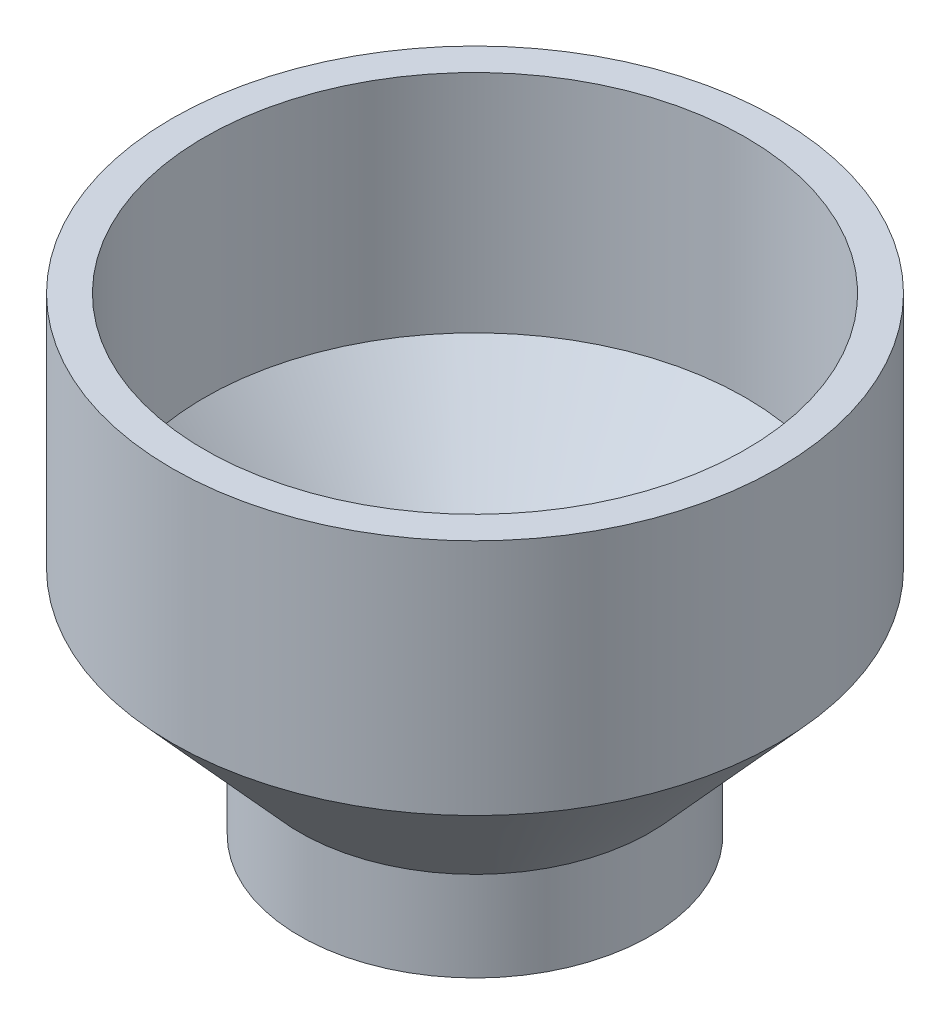
ISO-10303-21;
HEADER;
FILE_DESCRIPTION(('STEP AP214'),'2;1');
FILE_NAME('part.step','',(''),(''),'','','');
FILE_SCHEMA(('AUTOMOTIVE_DESIGN { 1 0 10303 214 1 1 1 1 }'));
ENDSEC;
DATA;
#1=APPLICATION_CONTEXT('core data for automotive mechanical design processes');
#2=APPLICATION_PROTOCOL_DEFINITION('international standard','automotive_design',2000,#1);
#3=PRODUCT_CONTEXT('',#1,'mechanical');
#4=PRODUCT('Part','Part','',(#3));
#5=PRODUCT_RELATED_PRODUCT_CATEGORY('part','',(#4));
#6=PRODUCT_DEFINITION_FORMATION('','',#4);
#7=PRODUCT_DEFINITION_CONTEXT('part definition',#1,'design');
#8=PRODUCT_DEFINITION('design','',#6,#7);
#9=PRODUCT_DEFINITION_SHAPE('','',#8);
#10=(LENGTH_UNIT() NAMED_UNIT(*) SI_UNIT(.MILLI.,.METRE.));
#11=(NAMED_UNIT(*) PLANE_ANGLE_UNIT() SI_UNIT($,.RADIAN.));
#12=(NAMED_UNIT(*) SI_UNIT($,.STERADIAN.) SOLID_ANGLE_UNIT());
#13=UNCERTAINTY_MEASURE_WITH_UNIT(LENGTH_MEASURE(1.E-05),#10,'distance_accuracy_value','');
#14=(GEOMETRIC_REPRESENTATION_CONTEXT(3) GLOBAL_UNCERTAINTY_ASSIGNED_CONTEXT((#13)) GLOBAL_UNIT_ASSIGNED_CONTEXT((#10,
#11,#12)) REPRESENTATION_CONTEXT('',''));
#15=CARTESIAN_POINT('',(0.,0.,0.));
#16=DIRECTION('',(0.,0.,1.));
#17=DIRECTION('',(1.,0.,0.));
#18=AXIS2_PLACEMENT_3D('',#15,#16,#17);
#19=CARTESIAN_POINT('',(0.,0.,0.));
#20=DIRECTION('',(0.,-1.,0.));
#21=DIRECTION('',(0.,0.,-1.));
#22=AXIS2_PLACEMENT_3D('',#19,#20,#21);
#23=CYLINDRICAL_SURFACE('',#22,37.0205);
#24=CARTESIAN_POINT('',(0.,-99.06,0.));
#25=DIRECTION('',(0.,-1.,0.));
#26=DIRECTION('',(0.,0.,-1.));
#27=AXIS2_PLACEMENT_3D('',#24,#25,#26);
#28=CIRCLE('',#27,37.0205);
#29=CARTESIAN_POINT('',(0.,-99.06,-37.0205));
#30=VERTEX_POINT('',#29);
#31=EDGE_CURVE('E76',#30,#30,#28,.T.);
#32=ORIENTED_EDGE('',*,*,#31,.F.);
#33=EDGE_LOOP('',(#32));
#34=FACE_BOUND('',#33,.T.);
#35=CARTESIAN_POINT('',(0.,-80.1108948324947,0.));
#36=DIRECTION('',(0.,-1.,0.));
#37=DIRECTION('',(0.,0.,-1.));
#38=AXIS2_PLACEMENT_3D('',#35,#36,#37);
#39=CIRCLE('',#38,37.0205);
#40=CARTESIAN_POINT('',(0.,-80.1108948324947,-37.0205));
#41=VERTEX_POINT('',#40);
#42=EDGE_CURVE('E10',#41,#41,#39,.T.);
#43=ORIENTED_EDGE('',*,*,#42,.T.);
#44=EDGE_LOOP('',(#43));
#45=FACE_BOUND('',#44,.T.);
#46=ADVANCED_FACE('F41',(#34,#45),#23,.T.);
#47=CARTESIAN_POINT('',(0.,-50.2658948324947,0.));
#48=DIRECTION('',(0.,1.,0.));
#49=DIRECTION('',(0.,0.,1.));
#50=AXIS2_PLACEMENT_3D('',#47,#48,#49);
#51=CONICAL_SURFACE('',#50,64.008,0.735161138538107);
#52=ORIENTED_EDGE('',*,*,#42,.F.);
#53=EDGE_LOOP('',(#52));
#54=FACE_BOUND('',#53,.T.);
#55=CARTESIAN_POINT('',(0.,-50.2658948324947,0.));
#56=DIRECTION('',(0.,-1.,0.));
#57=DIRECTION('',(0.,0.,-1.));
#58=AXIS2_PLACEMENT_3D('',#55,#56,#57);
#59=CIRCLE('',#58,64.008);
#60=CARTESIAN_POINT('',(0.,-50.2658948324947,-64.008));
#61=VERTEX_POINT('',#60);
#62=EDGE_CURVE('E48',#61,#61,#59,.T.);
#63=ORIENTED_EDGE('',*,*,#62,.T.);
#64=EDGE_LOOP('',(#63));
#65=FACE_BOUND('',#64,.T.);
#66=ADVANCED_FACE('F85',(#54,#65),#51,.T.);
#67=CARTESIAN_POINT('',(0.,0.,0.));
#68=DIRECTION('',(0.,-1.,0.));
#69=DIRECTION('',(0.,0.,-1.));
#70=AXIS2_PLACEMENT_3D('',#67,#68,#69);
#71=CYLINDRICAL_SURFACE('',#70,64.008);
#72=ORIENTED_EDGE('',*,*,#62,.F.);
#73=EDGE_LOOP('',(#72));
#74=FACE_BOUND('',#73,.T.);
#75=CARTESIAN_POINT('',(0.,0.,0.));
#76=DIRECTION('',(0.,-1.,0.));
#77=DIRECTION('',(0.,0.,-1.));
#78=AXIS2_PLACEMENT_3D('',#75,#76,#77);
#79=CIRCLE('',#78,64.008);
#80=CARTESIAN_POINT('',(0.,0.,-64.008));
#81=VERTEX_POINT('',#80);
#82=EDGE_CURVE('E55',#81,#81,#79,.T.);
#83=ORIENTED_EDGE('',*,*,#82,.T.);
#84=EDGE_LOOP('',(#83));
#85=FACE_BOUND('',#84,.T.);
#86=ADVANCED_FACE('F89',(#74,#85),#71,.T.);
#87=CARTESIAN_POINT('',(-64.008,0.,0.));
#88=DIRECTION('',(0.,1.,0.));
#89=DIRECTION('',(0.,0.,1.));
#90=AXIS2_PLACEMENT_3D('',#87,#88,#89);
#91=PLANE('',#90);
#92=CARTESIAN_POINT('',(0.,0.,0.));
#93=DIRECTION('',(0.,-1.,0.));
#94=DIRECTION('',(0.,0.,-1.));
#95=AXIS2_PLACEMENT_3D('',#92,#93,#94);
#96=CIRCLE('',#95,57.15);
#97=CARTESIAN_POINT('',(0.,0.,-57.15));
#98=VERTEX_POINT('',#97);
#99=EDGE_CURVE('E61',#98,#98,#96,.T.);
#100=ORIENTED_EDGE('',*,*,#99,.T.);
#101=EDGE_LOOP('',(#100));
#102=FACE_BOUND('',#101,.T.);
#103=ORIENTED_EDGE('',*,*,#82,.F.);
#104=EDGE_LOOP('',(#103));
#105=FACE_BOUND('',#104,.T.);
#106=ADVANCED_FACE('F94',(#102,#105),#91,.T.);
#107=CARTESIAN_POINT('',(0.,0.,0.));
#108=DIRECTION('',(0.,-1.,0.));
#109=DIRECTION('',(0.,0.,-1.));
#110=AXIS2_PLACEMENT_3D('',#107,#108,#109);
#111=CYLINDRICAL_SURFACE('',#110,57.15);
#112=CARTESIAN_POINT('',(0.,-47.625,0.));
#113=DIRECTION('',(0.,-1.,0.));
#114=DIRECTION('',(0.,0.,-1.));
#115=AXIS2_PLACEMENT_3D('',#112,#113,#114);
#116=CIRCLE('',#115,57.15);
#117=CARTESIAN_POINT('',(0.,-47.625,-57.15));
#118=VERTEX_POINT('',#117);
#119=EDGE_CURVE('E66',#118,#118,#116,.T.);
#120=ORIENTED_EDGE('',*,*,#119,.T.);
#121=EDGE_LOOP('',(#120));
#122=FACE_BOUND('',#121,.T.);
#123=ORIENTED_EDGE('',*,*,#99,.F.);
#124=EDGE_LOOP('',(#123));
#125=FACE_BOUND('',#124,.T.);
#126=ADVANCED_FACE('F100',(#122,#125),#111,.F.);
#127=CARTESIAN_POINT('',(0.,-47.625,0.));
#128=DIRECTION('',(0.,1.,0.));
#129=DIRECTION('',(0.,0.,1.));
#130=AXIS2_PLACEMENT_3D('',#127,#128,#129);
#131=CONICAL_SURFACE('',#130,57.15,0.735161138538107);
#132=CARTESIAN_POINT('',(0.,-77.47,0.));
#133=DIRECTION('',(0.,-1.,0.));
#134=DIRECTION('',(0.,0.,-1.));
#135=AXIS2_PLACEMENT_3D('',#132,#133,#134);
#136=CIRCLE('',#135,30.1625);
#137=CARTESIAN_POINT('',(0.,-77.47,-30.1625));
#138=VERTEX_POINT('',#137);
#139=EDGE_CURVE('E69',#138,#138,#136,.T.);
#140=ORIENTED_EDGE('',*,*,#139,.T.);
#141=EDGE_LOOP('',(#140));
#142=FACE_BOUND('',#141,.T.);
#143=ORIENTED_EDGE('',*,*,#119,.F.);
#144=EDGE_LOOP('',(#143));
#145=FACE_BOUND('',#144,.T.);
#146=ADVANCED_FACE('F104',(#142,#145),#131,.F.);
#147=CARTESIAN_POINT('',(0.,0.,0.));
#148=DIRECTION('',(0.,-1.,0.));
#149=DIRECTION('',(0.,0.,-1.));
#150=AXIS2_PLACEMENT_3D('',#147,#148,#149);
#151=CYLINDRICAL_SURFACE('',#150,30.1625);
#152=CARTESIAN_POINT('',(0.,-99.06,0.));
#153=DIRECTION('',(0.,-1.,0.));
#154=DIRECTION('',(0.,0.,-1.));
#155=AXIS2_PLACEMENT_3D('',#152,#153,#154);
#156=CIRCLE('',#155,30.1625);
#157=CARTESIAN_POINT('',(0.,-99.06,-30.1625));
#158=VERTEX_POINT('',#157);
#159=EDGE_CURVE('E72',#158,#158,#156,.T.);
#160=ORIENTED_EDGE('',*,*,#159,.T.);
#161=EDGE_LOOP('',(#160));
#162=FACE_BOUND('',#161,.T.);
#163=ORIENTED_EDGE('',*,*,#139,.F.);
#164=EDGE_LOOP('',(#163));
#165=FACE_BOUND('',#164,.T.);
#166=ADVANCED_FACE('F108',(#162,#165),#151,.F.);
#167=CARTESIAN_POINT('',(-30.1625,-99.06,0.));
#168=DIRECTION('',(0.,-1.,0.));
#169=DIRECTION('',(0.,0.,-1.));
#170=AXIS2_PLACEMENT_3D('',#167,#168,#169);
#171=PLANE('',#170);
#172=ORIENTED_EDGE('',*,*,#31,.T.);
#173=EDGE_LOOP('',(#172));
#174=FACE_BOUND('',#173,.T.);
#175=ORIENTED_EDGE('',*,*,#159,.F.);
#176=EDGE_LOOP('',(#175));
#177=FACE_BOUND('',#176,.T.);
#178=ADVANCED_FACE('F81',(#174,#177),#171,.T.);
#179=CLOSED_SHELL('',(#46,#66,#86,#106,#126,#146,#166,#178));
#180=MANIFOLD_SOLID_BREP('B2',#179);
#181=ADVANCED_BREP_SHAPE_REPRESENTATION('',(#18,#180),#14);
#182=SHAPE_DEFINITION_REPRESENTATION(#9,#181);
ENDSEC;
END-ISO-10303-21;
